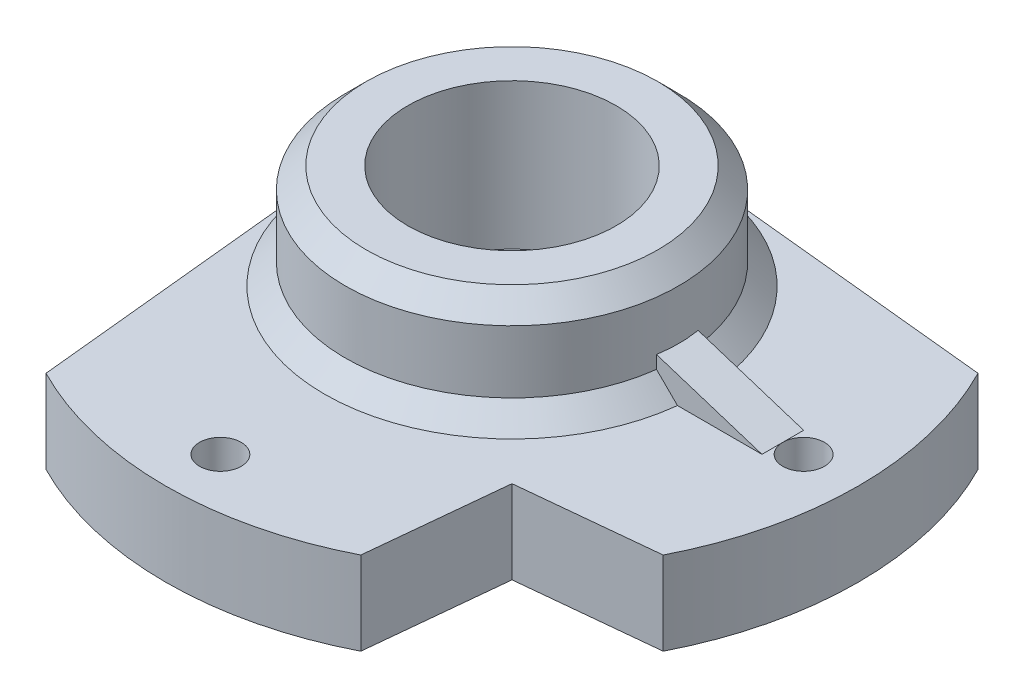
ISO-10303-21;
HEADER;
FILE_DESCRIPTION(('STEP AP214'),'2;1');
FILE_NAME('part.step','',(''),(''),'','','');
FILE_SCHEMA(('AUTOMOTIVE_DESIGN { 1 0 10303 214 1 1 1 1 }'));
ENDSEC;
DATA;
#1=APPLICATION_CONTEXT('core data for automotive mechanical design processes');
#2=APPLICATION_PROTOCOL_DEFINITION('international standard','automotive_design',2000,#1);
#3=PRODUCT_CONTEXT('',#1,'mechanical');
#4=PRODUCT('Part','Part','',(#3));
#5=PRODUCT_RELATED_PRODUCT_CATEGORY('part','',(#4));
#6=PRODUCT_DEFINITION_FORMATION('','',#4);
#7=PRODUCT_DEFINITION_CONTEXT('part definition',#1,'design');
#8=PRODUCT_DEFINITION('design','',#6,#7);
#9=PRODUCT_DEFINITION_SHAPE('','',#8);
#10=(LENGTH_UNIT() NAMED_UNIT(*) SI_UNIT(.MILLI.,.METRE.));
#11=(NAMED_UNIT(*) PLANE_ANGLE_UNIT() SI_UNIT($,.RADIAN.));
#12=(NAMED_UNIT(*) SI_UNIT($,.STERADIAN.) SOLID_ANGLE_UNIT());
#13=UNCERTAINTY_MEASURE_WITH_UNIT(LENGTH_MEASURE(1.E-05),#10,'distance_accuracy_value','');
#14=(GEOMETRIC_REPRESENTATION_CONTEXT(3) GLOBAL_UNCERTAINTY_ASSIGNED_CONTEXT((#13)) GLOBAL_UNIT_ASSIGNED_CONTEXT((#10,
#11,#12)) REPRESENTATION_CONTEXT('',''));
#15=CARTESIAN_POINT('',(0.,0.,0.));
#16=DIRECTION('',(0.,0.,1.));
#17=DIRECTION('',(1.,0.,0.));
#18=AXIS2_PLACEMENT_3D('',#15,#16,#17);
#19=CARTESIAN_POINT('',(0.,0.,0.));
#20=DIRECTION('',(0.,1.,0.));
#21=DIRECTION('',(0.,0.,1.));
#22=AXIS2_PLACEMENT_3D('',#19,#20,#21);
#23=PLANE('',#22);
#24=CARTESIAN_POINT('',(0.,0.,0.));
#25=DIRECTION('',(0.,1.,0.));
#26=DIRECTION('',(0.,0.,1.));
#27=AXIS2_PLACEMENT_3D('',#24,#25,#26);
#28=CIRCLE('',#27,3.5);
#29=CARTESIAN_POINT('',(0.,0.,3.5));
#30=VERTEX_POINT('',#29);
#31=EDGE_CURVE('E249',#30,#30,#28,.F.);
#32=ORIENTED_EDGE('',*,*,#31,.F.);
#33=EDGE_LOOP('',(#32));
#34=FACE_BOUND('',#33,.T.);
#35=CARTESIAN_POINT('',(7.00000000000001,0.,0.));
#36=DIRECTION('',(0.,1.,0.));
#37=DIRECTION('',(0.,0.,1.));
#38=AXIS2_PLACEMENT_3D('',#35,#36,#37);
#39=CIRCLE('',#38,0.499999999999999);
#40=CARTESIAN_POINT('',(7.00000000000001,0.,0.499999999999999));
#41=VERTEX_POINT('',#40);
#42=EDGE_CURVE('E243',#41,#41,#39,.F.);
#43=ORIENTED_EDGE('',*,*,#42,.F.);
#44=EDGE_LOOP('',(#43));
#45=FACE_BOUND('',#44,.T.);
#46=CARTESIAN_POINT('',(0.,0.,7.00000000000001));
#47=DIRECTION('',(0.,-1.,0.));
#48=DIRECTION('',(0.,0.,-1.));
#49=AXIS2_PLACEMENT_3D('',#46,#47,#48);
#50=CIRCLE('',#49,0.499999999999999);
#51=CARTESIAN_POINT('',(0.,0.,6.50000000000001));
#52=VERTEX_POINT('',#51);
#53=EDGE_CURVE('E142',#52,#52,#50,.T.);
#54=ORIENTED_EDGE('',*,*,#53,.F.);
#55=EDGE_LOOP('',(#54));
#56=FACE_BOUND('',#55,.T.);
#57=CARTESIAN_POINT('',(0.,0.,0.));
#58=DIRECTION('',(0.,1.,0.));
#59=DIRECTION('',(0.,0.,1.));
#60=AXIS2_PLACEMENT_3D('',#57,#58,#59);
#61=CIRCLE('',#60,8.31530299029882);
#62=CARTESIAN_POINT('',(7.40739327494629,0.,3.77819913328467));
#63=VERTEX_POINT('',#62);
#64=CARTESIAN_POINT('',(7.40739327494629,0.,-3.77819913328468));
#65=VERTEX_POINT('',#64);
#66=EDGE_CURVE('E48',#63,#65,#61,.T.);
#67=ORIENTED_EDGE('',*,*,#66,.F.);
#68=DIRECTION('',(0.99498743710662,0.,-0.1));
#69=VECTOR('',#68,1.);
#70=CARTESIAN_POINT('',(0.45,0.,4.47744346697979));
#71=LINE('',#70,#69);
#72=CARTESIAN_POINT('',(4.10963619079574,0.,4.1096361907957));
#73=VERTEX_POINT('',#72);
#74=EDGE_CURVE('E484',#73,#63,#71,.T.);
#75=ORIENTED_EDGE('',*,*,#74,.F.);
#76=DIRECTION('',(-0.0999999999999894,0.,0.994987437106621));
#77=VECTOR('',#76,1.);
#78=CARTESIAN_POINT('',(4.10963619079574,0.,4.1096361907957));
#79=LINE('',#78,#77);
#80=CARTESIAN_POINT('',(3.77819913328475,0.,7.40739327494625));
#81=VERTEX_POINT('',#80);
#82=EDGE_CURVE('E139',#73,#81,#79,.T.);
#83=ORIENTED_EDGE('',*,*,#82,.T.);
#84=CARTESIAN_POINT('',(-3.7781991332846,0.,7.40739327494633));
#85=VERTEX_POINT('',#84);
#86=EDGE_CURVE('E56',#85,#81,#61,.T.);
#87=ORIENTED_EDGE('',*,*,#86,.F.);
#88=DIRECTION('',(-0.10000000000001,0.,-0.994987437106619));
#89=VECTOR('',#88,1.);
#90=CARTESIAN_POINT('',(-4.10963619079566,0.,4.10963619079573));
#91=LINE('',#90,#89);
#92=CARTESIAN_POINT('',(-4.47744346697978,0.,0.450000000000046));
#93=VERTEX_POINT('',#92);
#94=EDGE_CURVE('E136',#85,#93,#91,.T.);
#95=ORIENTED_EDGE('',*,*,#94,.T.);
#96=CARTESIAN_POINT('',(0.,0.,0.));
#97=DIRECTION('',(0.,1.,0.));
#98=DIRECTION('',(0.,0.,-1.));
#99=AXIS2_PLACEMENT_3D('',#96,#97,#98);
#100=CIRCLE('',#99,4.5);
#101=CARTESIAN_POINT('',(0.449999999999999,0.,-4.47744346697979));
#102=VERTEX_POINT('',#101);
#103=EDGE_CURVE('E446',#102,#93,#100,.T.);
#104=ORIENTED_EDGE('',*,*,#103,.F.);
#105=DIRECTION('',(0.99498743710662,0.,0.0999999999999998));
#106=VECTOR('',#105,1.);
#107=CARTESIAN_POINT('',(0.449999999999999,0.,-4.47744346697979));
#108=LINE('',#107,#106);
#109=EDGE_CURVE('E473',#102,#65,#108,.T.);
#110=ORIENTED_EDGE('',*,*,#109,.T.);
#111=EDGE_LOOP('',(#67,#75,#83,#87,#95,#104,#110));
#112=FACE_BOUND('',#111,.T.);
#113=ADVANCED_FACE('F33',(#34,#45,#56,#112),#23,.F.);
#114=CARTESIAN_POINT('',(0.,2.,0.));
#115=DIRECTION('',(0.,1.,0.));
#116=DIRECTION('',(0.,0.,1.));
#117=AXIS2_PLACEMENT_3D('',#114,#115,#116);
#118=PLANE('',#117);
#119=CARTESIAN_POINT('',(0.,2.,7.00000000000001));
#120=DIRECTION('',(0.,-1.,0.));
#121=DIRECTION('',(0.,0.,-1.));
#122=AXIS2_PLACEMENT_3D('',#119,#120,#121);
#123=CIRCLE('',#122,0.499999999999999);
#124=CARTESIAN_POINT('',(0.,2.,6.50000000000001));
#125=VERTEX_POINT('',#124);
#126=EDGE_CURVE('E145',#125,#125,#123,.T.);
#127=ORIENTED_EDGE('',*,*,#126,.T.);
#128=EDGE_LOOP('',(#127));
#129=FACE_BOUND('',#128,.T.);
#130=DIRECTION('',(0.99498743710662,0.,-0.1));
#131=VECTOR('',#130,1.);
#132=CARTESIAN_POINT('',(0.45,2.,4.47744346697979));
#133=LINE('',#132,#131);
#134=CARTESIAN_POINT('',(4.10963619079574,2.,4.1096361907957));
#135=VERTEX_POINT('',#134);
#136=CARTESIAN_POINT('',(7.40739327494629,2.,3.77819913328467));
#137=VERTEX_POINT('',#136);
#138=EDGE_CURVE('E477',#135,#137,#133,.T.);
#139=ORIENTED_EDGE('',*,*,#138,.T.);
#140=CARTESIAN_POINT('',(0.,2.,0.));
#141=DIRECTION('',(0.,1.,0.));
#142=DIRECTION('',(0.,0.,1.));
#143=AXIS2_PLACEMENT_3D('',#140,#141,#142);
#144=CIRCLE('',#143,8.31530299029882);
#145=CARTESIAN_POINT('',(7.40739327494629,2.,-3.77819913328468));
#146=VERTEX_POINT('',#145);
#147=EDGE_CURVE('E132',#137,#146,#144,.T.);
#148=ORIENTED_EDGE('',*,*,#147,.T.);
#149=DIRECTION('',(0.99498743710662,0.,0.0999999999999998));
#150=VECTOR('',#149,1.);
#151=CARTESIAN_POINT('',(0.449999999999999,2.,-4.47744346697979));
#152=LINE('',#151,#150);
#153=CARTESIAN_POINT('',(0.449999999999999,2.,-4.47744346697979));
#154=VERTEX_POINT('',#153);
#155=EDGE_CURVE('E472',#154,#146,#152,.T.);
#156=ORIENTED_EDGE('',*,*,#155,.F.);
#157=CARTESIAN_POINT('',(0.,2.,0.));
#158=DIRECTION('',(0.,1.,0.));
#159=DIRECTION('',(0.,0.,1.));
#160=AXIS2_PLACEMENT_3D('',#157,#158,#159);
#161=CIRCLE('',#160,4.5);
#162=CARTESIAN_POINT('',(4.47213595499958,2.,-0.5));
#163=VERTEX_POINT('',#162);
#164=EDGE_CURVE('E475',#163,#154,#161,.T.);
#165=ORIENTED_EDGE('',*,*,#164,.F.);
#166=DIRECTION('',(1.,0.,0.));
#167=VECTOR('',#166,1.);
#168=CARTESIAN_POINT('',(0.,2.,-0.5));
#169=LINE('',#168,#167);
#170=CARTESIAN_POINT('',(6.50000000000001,2.,-0.5));
#171=VERTEX_POINT('',#170);
#172=EDGE_CURVE('E530',#163,#171,#169,.T.);
#173=ORIENTED_EDGE('',*,*,#172,.T.);
#174=DIRECTION('',(0.,0.,1.));
#175=VECTOR('',#174,1.);
#176=CARTESIAN_POINT('',(6.50000000000001,2.,0.));
#177=LINE('',#176,#175);
#178=CARTESIAN_POINT('',(6.50000000000001,2.,0.));
#179=VERTEX_POINT('',#178);
#180=EDGE_CURVE('E516',#179,#171,#177,.F.);
#181=ORIENTED_EDGE('',*,*,#180,.F.);
#182=CARTESIAN_POINT('',(7.00000000000001,2.,0.));
#183=DIRECTION('',(0.,1.,0.));
#184=DIRECTION('',(0.,0.,1.));
#185=AXIS2_PLACEMENT_3D('',#182,#183,#184);
#186=CIRCLE('',#185,0.499999999999999);
#187=EDGE_CURVE('E240',#179,#179,#186,.T.);
#188=ORIENTED_EDGE('',*,*,#187,.F.);
#189=CARTESIAN_POINT('',(6.50000000000001,2.,0.5));
#190=VERTEX_POINT('',#189);
#191=EDGE_CURVE('E515',#190,#179,#177,.F.);
#192=ORIENTED_EDGE('',*,*,#191,.F.);
#193=DIRECTION('',(1.,0.,0.));
#194=VECTOR('',#193,1.);
#195=CARTESIAN_POINT('',(0.,2.,0.5));
#196=LINE('',#195,#194);
#197=CARTESIAN_POINT('',(4.47213595499958,2.,0.5));
#198=VERTEX_POINT('',#197);
#199=EDGE_CURVE('E521',#198,#190,#196,.T.);
#200=ORIENTED_EDGE('',*,*,#199,.F.);
#201=CARTESIAN_POINT('',(-4.47744346697978,2.,0.450000000000046));
#202=VERTEX_POINT('',#201);
#203=EDGE_CURVE('E479',#202,#198,#161,.T.);
#204=ORIENTED_EDGE('',*,*,#203,.F.);
#205=DIRECTION('',(-0.10000000000001,0.,-0.994987437106619));
#206=VECTOR('',#205,1.);
#207=CARTESIAN_POINT('',(-4.10963619079566,2.,4.10963619079573));
#208=LINE('',#207,#206);
#209=CARTESIAN_POINT('',(-3.7781991332846,2.,7.40739327494633));
#210=VERTEX_POINT('',#209);
#211=EDGE_CURVE('E130',#210,#202,#208,.T.);
#212=ORIENTED_EDGE('',*,*,#211,.F.);
#213=CARTESIAN_POINT('',(3.77819913328475,2.,7.40739327494625));
#214=VERTEX_POINT('',#213);
#215=EDGE_CURVE('E117',#210,#214,#144,.T.);
#216=ORIENTED_EDGE('',*,*,#215,.T.);
#217=DIRECTION('',(-0.0999999999999894,0.,0.994987437106621));
#218=VECTOR('',#217,1.);
#219=CARTESIAN_POINT('',(4.10963619079574,2.,4.1096361907957));
#220=LINE('',#219,#218);
#221=EDGE_CURVE('E127',#135,#214,#220,.T.);
#222=ORIENTED_EDGE('',*,*,#221,.F.);
#223=EDGE_LOOP('',(#139,#148,#156,#165,#173,#181,#188,#192,#200,#204,#212,#216,#222));
#224=FACE_BOUND('',#223,.T.);
#225=ADVANCED_FACE('F126',(#129,#224),#118,.T.);
#226=CARTESIAN_POINT('',(0.45,2.,4.47744346697979));
#227=DIRECTION('',(-0.1,0.,-0.99498743710662));
#228=DIRECTION('',(-0.99498743710662,0.,0.1));
#229=AXIS2_PLACEMENT_3D('',#226,#227,#228);
#230=PLANE('',#229);
#231=DIRECTION('',(0.,-1.,0.));
#232=VECTOR('',#231,1.);
#233=CARTESIAN_POINT('',(7.40739327494629,4.5,3.77819913328468));
#234=LINE('',#233,#232);
#235=EDGE_CURVE('E451',#137,#63,#234,.T.);
#236=ORIENTED_EDGE('',*,*,#235,.F.);
#237=ORIENTED_EDGE('',*,*,#138,.F.);
#238=DIRECTION('',(0.,-1.,0.));
#239=VECTOR('',#238,1.);
#240=CARTESIAN_POINT('',(4.10963619079574,2.,4.1096361907957));
#241=LINE('',#240,#239);
#242=EDGE_CURVE('E135',#135,#73,#241,.T.);
#243=ORIENTED_EDGE('',*,*,#242,.T.);
#244=ORIENTED_EDGE('',*,*,#74,.T.);
#245=EDGE_LOOP('',(#236,#237,#243,#244));
#246=FACE_BOUND('',#245,.T.);
#247=ADVANCED_FACE('F219',(#246),#230,.F.);
#248=CARTESIAN_POINT('',(0.449999999999999,2.,-4.47744346697979));
#249=DIRECTION('',(0.0999999999999999,0.,-0.99498743710662));
#250=DIRECTION('',(-0.99498743710662,0.,-0.0999999999999998));
#251=AXIS2_PLACEMENT_3D('',#248,#249,#250);
#252=PLANE('',#251);
#253=ORIENTED_EDGE('',*,*,#155,.T.);
#254=DIRECTION('',(0.,-1.,0.));
#255=VECTOR('',#254,1.);
#256=CARTESIAN_POINT('',(7.40739327494629,4.5,-3.77819913328468));
#257=LINE('',#256,#255);
#258=EDGE_CURVE('E449',#146,#65,#257,.T.);
#259=ORIENTED_EDGE('',*,*,#258,.T.);
#260=ORIENTED_EDGE('',*,*,#109,.F.);
#261=DIRECTION('',(0.,-1.,0.));
#262=VECTOR('',#261,1.);
#263=CARTESIAN_POINT('',(0.449999999999999,10.,-4.47744346697979));
#264=LINE('',#263,#262);
#265=EDGE_CURVE('E458',#154,#102,#264,.T.);
#266=ORIENTED_EDGE('',*,*,#265,.F.);
#267=EDGE_LOOP('',(#253,#259,#260,#266));
#268=FACE_BOUND('',#267,.T.);
#269=ADVANCED_FACE('F224',(#268),#252,.T.);
#270=CARTESIAN_POINT('',(-4.10963619079566,2.,4.10963619079573));
#271=DIRECTION('',(-0.994987437106619,0.,0.10000000000001));
#272=DIRECTION('',(0.10000000000001,0.,0.994987437106619));
#273=AXIS2_PLACEMENT_3D('',#270,#271,#272);
#274=PLANE('',#273);
#275=ORIENTED_EDGE('',*,*,#94,.F.);
#276=DIRECTION('',(0.,-1.,0.));
#277=VECTOR('',#276,1.);
#278=CARTESIAN_POINT('',(-3.7781991332846,4.5,7.40739327494633));
#279=LINE('',#278,#277);
#280=EDGE_CURVE('E439',#85,#210,#279,.F.);
#281=ORIENTED_EDGE('',*,*,#280,.T.);
#282=ORIENTED_EDGE('',*,*,#211,.T.);
#283=DIRECTION('',(0.,-1.,0.));
#284=VECTOR('',#283,1.);
#285=CARTESIAN_POINT('',(-4.47744346697978,10.,0.450000000000046));
#286=LINE('',#285,#284);
#287=EDGE_CURVE('E441',#202,#93,#286,.T.);
#288=ORIENTED_EDGE('',*,*,#287,.T.);
#289=EDGE_LOOP('',(#275,#281,#282,#288));
#290=FACE_BOUND('',#289,.T.);
#291=ADVANCED_FACE('F227',(#290),#274,.T.);
#292=CARTESIAN_POINT('',(4.10963619079574,2.,4.1096361907957));
#293=DIRECTION('',(0.994987437106621,0.,0.0999999999999894));
#294=DIRECTION('',(0.0999999999999894,0.,-0.994987437106621));
#295=AXIS2_PLACEMENT_3D('',#292,#293,#294);
#296=PLANE('',#295);
#297=ORIENTED_EDGE('',*,*,#221,.T.);
#298=DIRECTION('',(0.,-1.,0.));
#299=VECTOR('',#298,1.);
#300=CARTESIAN_POINT('',(3.77819913328475,4.5,7.40739327494625));
#301=LINE('',#300,#299);
#302=EDGE_CURVE('E12',#214,#81,#301,.T.);
#303=ORIENTED_EDGE('',*,*,#302,.T.);
#304=ORIENTED_EDGE('',*,*,#82,.F.);
#305=ORIENTED_EDGE('',*,*,#242,.F.);
#306=EDGE_LOOP('',(#297,#303,#304,#305));
#307=FACE_BOUND('',#306,.T.);
#308=ADVANCED_FACE('F133',(#307),#296,.T.);
#309=CARTESIAN_POINT('',(0.,-0.301,0.));
#310=DIRECTION('',(0.,1.,0.));
#311=DIRECTION('',(0.,0.,1.));
#312=AXIS2_PLACEMENT_3D('',#309,#310,#311);
#313=CYLINDRICAL_SURFACE('',#312,1.35);
#314=CARTESIAN_POINT('',(0.,0.3,0.));
#315=DIRECTION('',(0.,-1.,0.));
#316=DIRECTION('',(0.,0.,-1.));
#317=AXIS2_PLACEMENT_3D('',#314,#315,#316);
#318=CIRCLE('',#317,1.35);
#319=CARTESIAN_POINT('',(0.,0.3,-1.35));
#320=VERTEX_POINT('',#319);
#321=EDGE_CURVE('E512',#320,#320,#318,.T.);
#322=ORIENTED_EDGE('',*,*,#321,.T.);
#323=EDGE_LOOP('',(#322));
#324=FACE_BOUND('',#323,.T.);
#325=CARTESIAN_POINT('',(0.,1.,0.));
#326=DIRECTION('',(0.,1.,0.));
#327=DIRECTION('',(0.,0.,1.));
#328=AXIS2_PLACEMENT_3D('',#325,#326,#327);
#329=CIRCLE('',#328,1.35);
#330=CARTESIAN_POINT('',(0.,1.,1.35));
#331=VERTEX_POINT('',#330);
#332=EDGE_CURVE('E504',#331,#331,#329,.T.);
#333=ORIENTED_EDGE('',*,*,#332,.T.);
#334=EDGE_LOOP('',(#333));
#335=FACE_BOUND('',#334,.T.);
#336=ADVANCED_FACE('F186',(#324,#335),#313,.F.);
#337=CARTESIAN_POINT('',(0.,4.5,0.));
#338=DIRECTION('',(0.,-1.,0.));
#339=DIRECTION('',(0.,0.,-1.));
#340=AXIS2_PLACEMENT_3D('',#337,#338,#339);
#341=CYLINDRICAL_SURFACE('',#340,4.);
#342=CARTESIAN_POINT('',(0.,2.50000000000001,0.));
#343=DIRECTION('',(0.,1.,0.));
#344=DIRECTION('',(0.,0.,1.));
#345=AXIS2_PLACEMENT_3D('',#342,#343,#344);
#346=CIRCLE('',#345,4.);
#347=CARTESIAN_POINT('',(3.96862696659689,2.50000000000001,-0.5));
#348=VERTEX_POINT('',#347);
#349=CARTESIAN_POINT('',(3.96862696659689,2.50000000000001,0.5));
#350=VERTEX_POINT('',#349);
#351=EDGE_CURVE('E245',#348,#350,#346,.T.);
#352=ORIENTED_EDGE('',*,*,#351,.T.);
#353=DIRECTION('',(0.,-1.,0.));
#354=VECTOR('',#353,1.);
#355=CARTESIAN_POINT('',(3.96862696659689,4.5,0.5));
#356=LINE('',#355,#354);
#357=CARTESIAN_POINT('',(3.96862696659689,2.810039370689,0.5));
#358=VERTEX_POINT('',#357);
#359=EDGE_CURVE('E524',#350,#358,#356,.F.);
#360=ORIENTED_EDGE('',*,*,#359,.T.);
#361=CARTESIAN_POINT('',(0.,4.07999999999999,0.));
#362=DIRECTION('',(-0.304775727103783,-0.952424147199324,0.));
#363=DIRECTION('',(0.952424147199325,-0.304775727103783,0.));
#364=AXIS2_PLACEMENT_3D('',#361,#362,#363);
#365=ELLIPSE('',#364,4.19980951949014,4.);
#366=CARTESIAN_POINT('',(3.96862696659689,2.810039370689,-0.5));
#367=VERTEX_POINT('',#366);
#368=EDGE_CURVE('E519',#358,#367,#365,.F.);
#369=ORIENTED_EDGE('',*,*,#368,.T.);
#370=DIRECTION('',(0.,-1.,0.));
#371=VECTOR('',#370,1.);
#372=CARTESIAN_POINT('',(3.96862696659689,4.5,-0.5));
#373=LINE('',#372,#371);
#374=EDGE_CURVE('E161',#348,#367,#373,.F.);
#375=ORIENTED_EDGE('',*,*,#374,.F.);
#376=EDGE_LOOP('',(#352,#360,#369,#375));
#377=FACE_BOUND('',#376,.T.);
#378=CARTESIAN_POINT('',(0.,3.99999999999999,0.));
#379=DIRECTION('',(0.,1.,0.));
#380=DIRECTION('',(0.,0.,1.));
#381=AXIS2_PLACEMENT_3D('',#378,#379,#380);
#382=CIRCLE('',#381,4.);
#383=CARTESIAN_POINT('',(0.,3.99999999999999,4.));
#384=VERTEX_POINT('',#383);
#385=EDGE_CURVE('E41',#384,#384,#382,.F.);
#386=ORIENTED_EDGE('',*,*,#385,.T.);
#387=EDGE_LOOP('',(#386));
#388=FACE_BOUND('',#387,.T.);
#389=ADVANCED_FACE('F189',(#377,#388),#341,.T.);
#390=CARTESIAN_POINT('',(0.,4.5,0.));
#391=DIRECTION('',(0.,1.,0.));
#392=DIRECTION('',(0.,0.,1.));
#393=AXIS2_PLACEMENT_3D('',#390,#391,#392);
#394=PLANE('',#393);
#395=CARTESIAN_POINT('',(0.,4.5,0.));
#396=DIRECTION('',(0.,1.,0.));
#397=DIRECTION('',(0.,0.,1.));
#398=AXIS2_PLACEMENT_3D('',#395,#396,#397);
#399=CIRCLE('',#398,2.5);
#400=CARTESIAN_POINT('',(0.,4.5,2.5));
#401=VERTEX_POINT('',#400);
#402=EDGE_CURVE('E501',#401,#401,#399,.T.);
#403=ORIENTED_EDGE('',*,*,#402,.F.);
#404=EDGE_LOOP('',(#403));
#405=FACE_BOUND('',#404,.T.);
#406=CARTESIAN_POINT('',(0.,4.5,0.));
#407=DIRECTION('',(0.,1.,0.));
#408=DIRECTION('',(0.,0.,1.));
#409=AXIS2_PLACEMENT_3D('',#406,#407,#408);
#410=CIRCLE('',#409,3.5);
#411=CARTESIAN_POINT('',(0.,4.5,3.5));
#412=VERTEX_POINT('',#411);
#413=EDGE_CURVE('E247',#412,#412,#410,.T.);
#414=ORIENTED_EDGE('',*,*,#413,.T.);
#415=EDGE_LOOP('',(#414));
#416=FACE_BOUND('',#415,.T.);
#417=ADVANCED_FACE('F206',(#405,#416),#394,.T.);
#418=CARTESIAN_POINT('',(0.,-0.3,0.));
#419=DIRECTION('',(0.,-1.,0.));
#420=DIRECTION('',(0.,0.,-1.));
#421=AXIS2_PLACEMENT_3D('',#418,#419,#420);
#422=PLANE('',#421);
#423=CARTESIAN_POINT('',(0.,-0.3,0.));
#424=DIRECTION('',(0.,-1.,0.));
#425=DIRECTION('',(0.,0.,-1.));
#426=AXIS2_PLACEMENT_3D('',#423,#424,#425);
#427=CIRCLE('',#426,2.5);
#428=CARTESIAN_POINT('',(0.,-0.3,-2.5));
#429=VERTEX_POINT('',#428);
#430=EDGE_CURVE('E496',#429,#429,#427,.T.);
#431=ORIENTED_EDGE('',*,*,#430,.F.);
#432=EDGE_LOOP('',(#431));
#433=FACE_BOUND('',#432,.T.);
#434=CARTESIAN_POINT('',(0.,-0.3,0.));
#435=DIRECTION('',(0.,-1.,0.));
#436=DIRECTION('',(0.,0.,-1.));
#437=AXIS2_PLACEMENT_3D('',#434,#435,#436);
#438=CIRCLE('',#437,3.5);
#439=CARTESIAN_POINT('',(0.,-0.3,-3.5));
#440=VERTEX_POINT('',#439);
#441=EDGE_CURVE('E487',#440,#440,#438,.T.);
#442=ORIENTED_EDGE('',*,*,#441,.T.);
#443=EDGE_LOOP('',(#442));
#444=FACE_BOUND('',#443,.T.);
#445=ADVANCED_FACE('F203',(#433,#444),#422,.T.);
#446=CARTESIAN_POINT('',(0.,-0.3,0.));
#447=DIRECTION('',(0.,1.,0.));
#448=DIRECTION('',(0.,0.,1.));
#449=AXIS2_PLACEMENT_3D('',#446,#447,#448);
#450=CYLINDRICAL_SURFACE('',#449,3.5);
#451=ORIENTED_EDGE('',*,*,#31,.T.);
#452=EDGE_LOOP('',(#451));
#453=FACE_BOUND('',#452,.T.);
#454=ORIENTED_EDGE('',*,*,#441,.F.);
#455=EDGE_LOOP('',(#454));
#456=FACE_BOUND('',#455,.T.);
#457=ADVANCED_FACE('F201',(#453,#456),#450,.T.);
#458=CARTESIAN_POINT('',(0.,-0.3,0.));
#459=DIRECTION('',(0.,1.,0.));
#460=DIRECTION('',(0.,0.,1.));
#461=AXIS2_PLACEMENT_3D('',#458,#459,#460);
#462=CYLINDRICAL_SURFACE('',#461,2.5);
#463=ORIENTED_EDGE('',*,*,#430,.T.);
#464=EDGE_LOOP('',(#463));
#465=FACE_BOUND('',#464,.T.);
#466=CARTESIAN_POINT('',(0.,0.3,0.));
#467=DIRECTION('',(0.,-1.,0.));
#468=DIRECTION('',(0.,0.,-1.));
#469=AXIS2_PLACEMENT_3D('',#466,#467,#468);
#470=CIRCLE('',#469,2.5);
#471=CARTESIAN_POINT('',(0.,0.3,-2.5));
#472=VERTEX_POINT('',#471);
#473=EDGE_CURVE('E509',#472,#472,#470,.T.);
#474=ORIENTED_EDGE('',*,*,#473,.F.);
#475=EDGE_LOOP('',(#474));
#476=FACE_BOUND('',#475,.T.);
#477=ADVANCED_FACE('F197',(#465,#476),#462,.F.);
#478=CARTESIAN_POINT('',(0.,1.,0.));
#479=DIRECTION('',(0.,1.,0.));
#480=DIRECTION('',(0.,0.,1.));
#481=AXIS2_PLACEMENT_3D('',#478,#479,#480);
#482=CYLINDRICAL_SURFACE('',#481,2.5);
#483=CARTESIAN_POINT('',(0.,1.,0.));
#484=DIRECTION('',(0.,1.,0.));
#485=DIRECTION('',(0.,0.,1.));
#486=AXIS2_PLACEMENT_3D('',#483,#484,#485);
#487=CIRCLE('',#486,2.5);
#488=CARTESIAN_POINT('',(0.,1.,2.5));
#489=VERTEX_POINT('',#488);
#490=EDGE_CURVE('E498',#489,#489,#487,.T.);
#491=ORIENTED_EDGE('',*,*,#490,.F.);
#492=EDGE_LOOP('',(#491));
#493=FACE_BOUND('',#492,.T.);
#494=ORIENTED_EDGE('',*,*,#402,.T.);
#495=EDGE_LOOP('',(#494));
#496=FACE_BOUND('',#495,.T.);
#497=ADVANCED_FACE('F193',(#493,#496),#482,.F.);
#498=CARTESIAN_POINT('',(0.,1.,0.));
#499=DIRECTION('',(0.,1.,0.));
#500=DIRECTION('',(0.,0.,1.));
#501=AXIS2_PLACEMENT_3D('',#498,#499,#500);
#502=PLANE('',#501);
#503=ORIENTED_EDGE('',*,*,#332,.F.);
#504=EDGE_LOOP('',(#503));
#505=FACE_BOUND('',#504,.T.);
#506=ORIENTED_EDGE('',*,*,#490,.T.);
#507=EDGE_LOOP('',(#506));
#508=FACE_BOUND('',#507,.T.);
#509=ADVANCED_FACE('F184',(#505,#508),#502,.T.);
#510=CARTESIAN_POINT('',(0.,0.3,0.));
#511=DIRECTION('',(0.,-1.,0.));
#512=DIRECTION('',(0.,0.,-1.));
#513=AXIS2_PLACEMENT_3D('',#510,#511,#512);
#514=PLANE('',#513);
#515=ORIENTED_EDGE('',*,*,#321,.F.);
#516=EDGE_LOOP('',(#515));
#517=FACE_BOUND('',#516,.T.);
#518=ORIENTED_EDGE('',*,*,#473,.T.);
#519=EDGE_LOOP('',(#518));
#520=FACE_BOUND('',#519,.T.);
#521=ADVANCED_FACE('F180',(#517,#520),#514,.T.);
#522=CARTESIAN_POINT('',(7.00000000000001,-0.301,0.));
#523=DIRECTION('',(0.,1.,0.));
#524=DIRECTION('',(0.,0.,1.));
#525=AXIS2_PLACEMENT_3D('',#522,#523,#524);
#526=CYLINDRICAL_SURFACE('',#525,0.499999999999999);
#527=ORIENTED_EDGE('',*,*,#187,.T.);
#528=EDGE_LOOP('',(#527));
#529=FACE_BOUND('',#528,.T.);
#530=ORIENTED_EDGE('',*,*,#42,.T.);
#531=EDGE_LOOP('',(#530));
#532=FACE_BOUND('',#531,.T.);
#533=ADVANCED_FACE('F183',(#529,#532),#526,.F.);
#534=CARTESIAN_POINT('',(0.,2.50000000000001,0.));
#535=DIRECTION('',(0.,-1.,0.));
#536=DIRECTION('',(0.,0.,-1.));
#537=AXIS2_PLACEMENT_3D('',#534,#535,#536);
#538=CONICAL_SURFACE('',#537,4.,0.785398163397441);
#539=ORIENTED_EDGE('',*,*,#164,.T.);
#540=EDGE_CURVE('E470',#154,#202,#161,.T.);
#541=ORIENTED_EDGE('',*,*,#540,.T.);
#542=ORIENTED_EDGE('',*,*,#203,.T.);
#543=CARTESIAN_POINT('',(9.89590347515211,-3.40852691319598,0.5));
#544=CARTESIAN_POINT('',(9.55754945793178,-3.07060741252557,0.5));
#545=CARTESIAN_POINT('',(9.21917661015534,-2.73270675664088,0.5));
#546=CARTESIAN_POINT('',(8.54236671432963,-2.05696500163337,0.5));
#547=CARTESIAN_POINT('',(8.20392966584675,-1.71912390294484,0.5));
#548=CARTESIAN_POINT('',(7.52691541260064,-1.04347381707137,0.5));
#549=CARTESIAN_POINT('',(7.18833819407591,-0.705664843675145,0.5));
#550=CARTESIAN_POINT('',(6.51105638737073,-0.0301792111346193,0.5));
#551=CARTESIAN_POINT('',(6.17235180007695,0.307497448898522,0.5));
#552=CARTESIAN_POINT('',(5.48700914449833,0.990336201412619,0.5));
#553=CARTESIAN_POINT('',(5.14036624498886,1.33549344504014,0.5));
#554=CARTESIAN_POINT('',(4.44669403602822,2.02543373511544,0.5));
#555=CARTESIAN_POINT('',(4.09966471892604,2.37021677387716,0.5));
#556=CARTESIAN_POINT('',(3.57853950614138,2.88676957712157,0.5));
#557=CARTESIAN_POINT('',(3.4047431652943,3.05884140217669,0.5));
#558=CARTESIAN_POINT('',(3.05682956444365,3.40266319432691,0.5));
#559=CARTESIAN_POINT('',(2.88271230182098,3.57441315877197,0.5));
#560=CARTESIAN_POINT('',(2.53396283642773,3.91737755367745,0.5));
#561=CARTESIAN_POINT('',(2.35933065316033,4.08859200392748,0.5));
#562=CARTESIAN_POINT('',(2.09664048952969,4.34465062179337,0.5));
#563=CARTESIAN_POINT('',(2.00895404094525,4.42987575218824,0.5));
#564=CARTESIAN_POINT('',(1.83321755870129,4.59995012050514,0.5));
#565=CARTESIAN_POINT('',(1.74516752680797,4.684799360249,0.5));
#566=CARTESIAN_POINT('',(1.60904335539765,4.8151164999807,0.5));
#567=CARTESIAN_POINT('',(1.56116546264021,4.86078929628022,0.5));
#568=CARTESIAN_POINT('',(1.4651971444848,4.9519123761549,0.5));
#569=CARTESIAN_POINT('',(1.4171067164316,4.99736265693508,0.5));
#570=CARTESIAN_POINT('',(1.32075784385142,5.08786422067677,0.5));
#571=CARTESIAN_POINT('',(1.27250003407477,5.13291617791471,0.5));
#572=CARTESIAN_POINT('',(1.17560877506877,5.22261095571533,0.5));
#573=CARTESIAN_POINT('',(1.12697533745554,5.26725378883737,0.5));
#574=CARTESIAN_POINT('',(1.01263433128632,5.37099419281247,0.5));
#575=CARTESIAN_POINT('',(0.946721447129669,5.42986767622625,0.5));
#576=CARTESIAN_POINT('',(0.846543842359696,5.51695941434939,0.5));
#577=CARTESIAN_POINT('',(0.812861376610706,5.54584609162679,0.5));
#578=CARTESIAN_POINT('',(0.744964714885904,5.60298613332747,0.5));
#579=CARTESIAN_POINT('',(0.71075055219924,5.63123953713117,0.5));
#580=CARTESIAN_POINT('',(0.641292410469585,5.6870886391154,0.5));
#581=CARTESIAN_POINT('',(0.606042049430044,5.71467644422043,0.5));
#582=CARTESIAN_POINT('',(0.534506835901469,5.76846767679602,0.5));
#583=CARTESIAN_POINT('',(0.498222350792911,5.79467158669548,0.5));
#584=CARTESIAN_POINT('',(0.424325281703803,5.84477920370247,0.5));
#585=CARTESIAN_POINT('',(0.386719668616044,5.8686930533328,0.5));
#586=CARTESIAN_POINT('',(0.309446037539682,5.91284615240152,0.5));
#587=CARTESIAN_POINT('',(0.269783796494129,5.93309504604604,0.5));
#588=CARTESIAN_POINT('',(0.198015133198507,5.96293784682987,0.5));
#589=CARTESIAN_POINT('',(0.166512414885312,5.97393051238842,0.5));
#590=CARTESIAN_POINT('',(0.102206781453443,5.99059379852334,0.5));
#591=CARTESIAN_POINT('',(0.0694110596774507,5.99629044688762,0.5));
#592=CARTESIAN_POINT('',(0.00296710682253621,6.00109365282088,0.5));
#593=CARTESIAN_POINT('',(-0.030686398656358,6.00013272949616,0.5));
#594=CARTESIAN_POINT('',(-0.0972255305893461,5.99171977434619,0.5));
#595=CARTESIAN_POINT('',(-0.130108177563559,5.98424581630359,0.5));
#596=CARTESIAN_POINT('',(-0.186074523719819,5.96698654587179,0.5));
#597=CARTESIAN_POINT('',(-0.209514544066126,5.95828031860342,0.5));
#598=CARTESIAN_POINT('',(-0.255559306667065,5.93886262508661,0.5));
#599=CARTESIAN_POINT('',(-0.278163407777664,5.92814965637227,0.5));
#600=CARTESIAN_POINT('',(-0.322709106996116,5.90521082605067,0.5));
#601=CARTESIAN_POINT('',(-0.344647155846754,5.89297819377031,0.5));
#602=CARTESIAN_POINT('',(-0.387867338008747,5.86743418204482,0.5));
#603=CARTESIAN_POINT('',(-0.40914973707126,5.8541232478189,0.5));
#604=CARTESIAN_POINT('',(-0.480182853185699,5.80781512978814,0.5));
#605=CARTESIAN_POINT('',(-0.528726550834765,5.77297947920479,0.5));
#606=CARTESIAN_POINT('',(-0.62404608468339,5.70095211311432,0.5));
#607=CARTESIAN_POINT('',(-0.670820208652472,5.66375820438946,0.5));
#608=CARTESIAN_POINT('',(-0.763330723074664,5.58787430089197,0.5));
#609=CARTESIAN_POINT('',(-0.809064241019628,5.54918081296965,0.5));
#610=CARTESIAN_POINT('',(-0.899737465138733,5.47091937446815,0.5));
#611=CARTESIAN_POINT('',(-0.944677492670236,5.43135179321739,0.5));
#612=CARTESIAN_POINT('',(-1.03411455802257,5.35152890898306,0.5));
#613=CARTESIAN_POINT('',(-1.0786104407946,5.31127231446442,0.5));
#614=CARTESIAN_POINT('',(-1.16721507431669,5.23032734290753,0.5));
#615=CARTESIAN_POINT('',(-1.21132378498587,5.18963892210681,0.5));
#616=CARTESIAN_POINT('',(-1.34308011009472,5.0672415511533,0.5));
#617=CARTESIAN_POINT('',(-1.43029975075579,4.98507238887022,0.5));
#618=CARTESIAN_POINT('',(-1.60326735499472,4.82078780728862,0.5));
#619=CARTESIAN_POINT('',(-1.68902147630657,4.73867884203772,0.5));
#620=CARTESIAN_POINT('',(-1.86009798958687,4.57401197875129,0.5));
#621=CARTESIAN_POINT('',(-1.94542037989989,4.49145407899688,0.5));
#622=CARTESIAN_POINT('',(-2.20096257848392,4.24333157501664,0.5));
#623=CARTESIAN_POINT('',(-2.37075157280255,4.07732375981561,0.5));
#624=CARTESIAN_POINT('',(-2.70984572950099,3.74460044019213,0.5));
#625=CARTESIAN_POINT('',(-2.87915051464704,3.57788455223487,0.5));
#626=CARTESIAN_POINT('',(-3.2174011966681,3.24409450505666,0.5));
#627=CARTESIAN_POINT('',(-3.38634709918735,3.07702035155454,0.5));
#628=CARTESIAN_POINT('',(-3.72347912903205,2.74317262021991,0.5));
#629=CARTESIAN_POINT('',(-3.89166596965963,2.57639976227976,0.5));
#630=CARTESIAN_POINT('',(-4.22788721516015,2.24269906968703,0.5));
#631=CARTESIAN_POINT('',(-4.39592161939077,2.07577123438735,0.5));
#632=CARTESIAN_POINT('',(-4.89979960506947,1.57489286053866,0.5));
#633=CARTESIAN_POINT('',(-5.23548388286576,1.24078208968793,0.5));
#634=CARTESIAN_POINT('',(-5.93120236876605,0.54784511619652,0.5));
#635=CARTESIAN_POINT('',(-6.29121899975219,0.189001273150897,0.5));
#636=CARTESIAN_POINT('',(-7.01111616859064,-0.528870872598339,0.5));
#637=CARTESIAN_POINT('',(-7.37099669576952,-0.88789918600477,0.5));
#638=CARTESIAN_POINT('',(-8.09176681799551,-1.60716633396484,0.5));
#639=CARTESIAN_POINT('',(-8.45265609833281,-1.96740548384958,0.5));
#640=CARTESIAN_POINT('',(-9.17433835992569,-2.68793177227881,0.5));
#641=CARTESIAN_POINT('',(-9.53513134602074,-3.04821890597593,0.5));
#642=CARTESIAN_POINT('',(-9.89590347515212,-3.40852691319598,0.5));
#643=B_SPLINE_CURVE_WITH_KNOTS('',3,(#543,#544,#545,#546,#547,#548,#549,#550,#551,#552,#553,
#554,#555,#556,#557,#558,#559,#560,#561,#562,#563,#564,#565,#566,#567,#568,#569,#570,#571,#572,
#573,#574,#575,#576,#577,#578,#579,#580,#581,#582,#583,#584,#585,#586,#587,#588,#589,#590,#591,
#592,#593,#594,#595,#596,#597,#598,#599,#600,#601,#602,#603,#604,#605,#606,#607,#608,#609,#610,
#611,#612,#613,#614,#615,#616,#617,#618,#619,#620,#621,#622,#623,#624,#625,#626,#627,#628,#629,
#630,#631,#632,#633,#634,#635,#636,#637,#638,#639,#640,#641,#642),.UNSPECIFIED.,.F.,.F.,(4,2,2,
2,2,2,2,2,2,2,2,2,2,2,2,2,2,2,2,2,2,2,2,2,2,2,2,2,2,2,2,2,2,2,2,2,2,2,2,2,2,2,2,2,2,2,2,2,2,4),
(0.,1.43459307786052,2.86919621654826,4.30402891346987,5.73885180040463,7.20638481865389,
8.67394742978777,9.40765341368392,10.1413654122587,10.8750499687968,11.2418873528939,
11.6087229570848,11.8072285087807,12.0057365474947,12.2037911275581,12.4018396072022,
12.6669493431006,12.8000626510363,12.9331676581586,13.0674344443483,13.2016541116298,
13.3352487975837,13.4684866537812,13.568266137643,13.66755261236,13.7678469127436,
13.8684801653078,13.9433912449627,14.0183586370525,14.0936728965318,14.1689562165301,
14.3480386638139,14.527290175544,14.70698781862,14.8866109342624,15.0666187948805,
15.2466450755806,15.6061243364409,15.9622979452581,16.3184729187517,17.0308471287563,
17.74367526124,18.4564920986339,19.1670551369796,19.8776211556317,21.2984746873746,
22.823410005948,24.3484469909793,25.8781920116444,27.4078343008316),.UNSPECIFIED.);
#644=EDGE_CURVE('E526',#198,#350,#643,.T.);
#645=ORIENTED_EDGE('',*,*,#644,.T.);
#646=ORIENTED_EDGE('',*,*,#351,.F.);
#647=CARTESIAN_POINT('',(9.89590347515212,-3.40852691319598,-0.5));
#648=CARTESIAN_POINT('',(9.55754945793178,-3.07060741252557,-0.5));
#649=CARTESIAN_POINT('',(9.21917661015534,-2.73270675664088,-0.5));
#650=CARTESIAN_POINT('',(8.54236671432963,-2.05696500163337,-0.5));
#651=CARTESIAN_POINT('',(8.20392966584676,-1.71912390294484,-0.5));
#652=CARTESIAN_POINT('',(7.52691541260065,-1.04347381707138,-0.5));
#653=CARTESIAN_POINT('',(7.18833819407591,-0.705664843675149,-0.5));
#654=CARTESIAN_POINT('',(6.51105638737074,-0.0301792111346253,-0.5));
#655=CARTESIAN_POINT('',(6.17235180007696,0.307497448898515,-0.5));
#656=CARTESIAN_POINT('',(5.48700914449834,0.990336201412611,-0.5));
#657=CARTESIAN_POINT('',(5.14036624498886,1.33549344504014,-0.5));
#658=CARTESIAN_POINT('',(4.44669403602823,2.02543373511544,-0.5));
#659=CARTESIAN_POINT('',(4.09966471892604,2.37021677387716,-0.5));
#660=CARTESIAN_POINT('',(3.57853950614138,2.88676957712157,-0.5));
#661=CARTESIAN_POINT('',(3.4047431652943,3.05884140217669,-0.5));
#662=CARTESIAN_POINT('',(3.05682956444365,3.40266319432691,-0.5));
#663=CARTESIAN_POINT('',(2.88271230182098,3.57441315877196,-0.5));
#664=CARTESIAN_POINT('',(2.53396283642773,3.91737755367745,-0.5));
#665=CARTESIAN_POINT('',(2.35933065316033,4.08859200392748,-0.5));
#666=CARTESIAN_POINT('',(2.09664048952969,4.34465062179337,-0.5));
#667=CARTESIAN_POINT('',(2.00895404094525,4.42987575218824,-0.5));
#668=CARTESIAN_POINT('',(1.83321755870129,4.59995012050514,-0.5));
#669=CARTESIAN_POINT('',(1.74516752680797,4.68479936024901,-0.5));
#670=CARTESIAN_POINT('',(1.60904335539765,4.8151164999807,-0.5));
#671=CARTESIAN_POINT('',(1.56116546264021,4.86078929628022,-0.5));
#672=CARTESIAN_POINT('',(1.4651971444848,4.9519123761549,-0.5));
#673=CARTESIAN_POINT('',(1.4171067164316,4.99736265693509,-0.5));
#674=CARTESIAN_POINT('',(1.32075784385142,5.08786422067677,-0.5));
#675=CARTESIAN_POINT('',(1.27250003407477,5.13291617791471,-0.5));
#676=CARTESIAN_POINT('',(1.17560877506877,5.22261095571533,-0.5));
#677=CARTESIAN_POINT('',(1.12697533745554,5.26725378883738,-0.5));
#678=CARTESIAN_POINT('',(1.01263433128632,5.37099419281248,-0.5));
#679=CARTESIAN_POINT('',(0.946721447129668,5.42986767622625,-0.5));
#680=CARTESIAN_POINT('',(0.846543842359695,5.51695941434939,-0.5));
#681=CARTESIAN_POINT('',(0.812861376610704,5.54584609162679,-0.5));
#682=CARTESIAN_POINT('',(0.744964714885903,5.60298613332747,-0.5));
#683=CARTESIAN_POINT('',(0.710750552199239,5.63123953713118,-0.5));
#684=CARTESIAN_POINT('',(0.641292410469584,5.6870886391154,-0.5));
#685=CARTESIAN_POINT('',(0.606042049430043,5.71467644422043,-0.5));
#686=CARTESIAN_POINT('',(0.534506835901468,5.76846767679602,-0.5));
#687=CARTESIAN_POINT('',(0.49822235079291,5.79467158669548,-0.5));
#688=CARTESIAN_POINT('',(0.424325281703802,5.84477920370247,-0.5));
#689=CARTESIAN_POINT('',(0.386719668616043,5.8686930533328,-0.5));
#690=CARTESIAN_POINT('',(0.309446037539682,5.91284615240152,-0.5));
#691=CARTESIAN_POINT('',(0.269783796494129,5.93309504604604,-0.5));
#692=CARTESIAN_POINT('',(0.198015133198507,5.96293784682987,-0.5));
#693=CARTESIAN_POINT('',(0.166512414885312,5.97393051238842,-0.5));
#694=CARTESIAN_POINT('',(0.102206781453443,5.99059379852334,-0.5));
#695=CARTESIAN_POINT('',(0.0694110596774504,5.99629044688762,-0.5));
#696=CARTESIAN_POINT('',(0.00296710682253653,6.00109365282088,-0.5));
#697=CARTESIAN_POINT('',(-0.030686398656357,6.00013272949616,-0.5));
#698=CARTESIAN_POINT('',(-0.0972255305893451,5.99171977434619,-0.5));
#699=CARTESIAN_POINT('',(-0.130108177563559,5.98424581630359,-0.5));
#700=CARTESIAN_POINT('',(-0.18607452371982,5.96698654587179,-0.5));
#701=CARTESIAN_POINT('',(-0.209514544066127,5.95828031860342,-0.5));
#702=CARTESIAN_POINT('',(-0.255559306667068,5.93886262508661,-0.5));
#703=CARTESIAN_POINT('',(-0.278163407777666,5.92814965637227,-0.5));
#704=CARTESIAN_POINT('',(-0.322709106996118,5.90521082605067,-0.5));
#705=CARTESIAN_POINT('',(-0.344647155846756,5.89297819377031,-0.5));
#706=CARTESIAN_POINT('',(-0.387867338008748,5.86743418204482,-0.5));
#707=CARTESIAN_POINT('',(-0.409149737071261,5.8541232478189,-0.5));
#708=CARTESIAN_POINT('',(-0.480182853185699,5.80781512978814,-0.5));
#709=CARTESIAN_POINT('',(-0.528726550834764,5.77297947920479,-0.5));
#710=CARTESIAN_POINT('',(-0.624046084683389,5.70095211311433,-0.5));
#711=CARTESIAN_POINT('',(-0.67082020865247,5.66375820438946,-0.5));
#712=CARTESIAN_POINT('',(-0.763330723074663,5.58787430089197,-0.5));
#713=CARTESIAN_POINT('',(-0.809064241019626,5.54918081296966,-0.5));
#714=CARTESIAN_POINT('',(-0.899737465138731,5.47091937446815,-0.5));
#715=CARTESIAN_POINT('',(-0.944677492670234,5.43135179321739,-0.5));
#716=CARTESIAN_POINT('',(-1.03411455802257,5.35152890898306,-0.5));
#717=CARTESIAN_POINT('',(-1.0786104407946,5.31127231446442,-0.5));
#718=CARTESIAN_POINT('',(-1.16721507431669,5.23032734290753,-0.5));
#719=CARTESIAN_POINT('',(-1.21132378498587,5.18963892210681,-0.5));
#720=CARTESIAN_POINT('',(-1.34308011009472,5.0672415511533,-0.5));
#721=CARTESIAN_POINT('',(-1.43029975075579,4.98507238887022,-0.5));
#722=CARTESIAN_POINT('',(-1.60326735499472,4.82078780728862,-0.5));
#723=CARTESIAN_POINT('',(-1.68902147630657,4.73867884203772,-0.5));
#724=CARTESIAN_POINT('',(-1.86009798958686,4.57401197875129,-0.5));
#725=CARTESIAN_POINT('',(-1.94542037989989,4.49145407899688,-0.5));
#726=CARTESIAN_POINT('',(-2.20096257848392,4.24333157501664,-0.5));
#727=CARTESIAN_POINT('',(-2.37075157280255,4.07732375981561,-0.5));
#728=CARTESIAN_POINT('',(-2.70984572950099,3.74460044019213,-0.5));
#729=CARTESIAN_POINT('',(-2.87915051464704,3.57788455223487,-0.5));
#730=CARTESIAN_POINT('',(-3.2174011966681,3.24409450505666,-0.5));
#731=CARTESIAN_POINT('',(-3.38634709918735,3.07702035155454,-0.5));
#732=CARTESIAN_POINT('',(-3.72347912903205,2.74317262021991,-0.5));
#733=CARTESIAN_POINT('',(-3.89166596965963,2.57639976227977,-0.5));
#734=CARTESIAN_POINT('',(-4.22788721516015,2.24269906968703,-0.5));
#735=CARTESIAN_POINT('',(-4.39592161939077,2.07577123438736,-0.5));
#736=CARTESIAN_POINT('',(-4.89979960506947,1.57489286053866,-0.5));
#737=CARTESIAN_POINT('',(-5.23548388286576,1.24078208968793,-0.5));
#738=CARTESIAN_POINT('',(-5.93120236876605,0.547845116196522,-0.5));
#739=CARTESIAN_POINT('',(-6.29121899975219,0.189001273150899,-0.5));
#740=CARTESIAN_POINT('',(-7.01111616859064,-0.528870872598339,-0.5));
#741=CARTESIAN_POINT('',(-7.37099669576952,-0.887899186004771,-0.5));
#742=CARTESIAN_POINT('',(-8.09176681799551,-1.60716633396485,-0.5));
#743=CARTESIAN_POINT('',(-8.45265609833281,-1.96740548384958,-0.5));
#744=CARTESIAN_POINT('',(-9.17433835992569,-2.6879317722788,-0.5));
#745=CARTESIAN_POINT('',(-9.53513134602075,-3.04821890597593,-0.5));
#746=CARTESIAN_POINT('',(-9.89590347515212,-3.40852691319599,-0.5));
#747=B_SPLINE_CURVE_WITH_KNOTS('',3,(#647,#648,#649,#650,#651,#652,#653,#654,#655,#656,#657,
#658,#659,#660,#661,#662,#663,#664,#665,#666,#667,#668,#669,#670,#671,#672,#673,#674,#675,#676,
#677,#678,#679,#680,#681,#682,#683,#684,#685,#686,#687,#688,#689,#690,#691,#692,#693,#694,#695,
#696,#697,#698,#699,#700,#701,#702,#703,#704,#705,#706,#707,#708,#709,#710,#711,#712,#713,#714,
#715,#716,#717,#718,#719,#720,#721,#722,#723,#724,#725,#726,#727,#728,#729,#730,#731,#732,#733,
#734,#735,#736,#737,#738,#739,#740,#741,#742,#743,#744,#745,#746),.UNSPECIFIED.,.F.,.F.,(4,2,2,
2,2,2,2,2,2,2,2,2,2,2,2,2,2,2,2,2,2,2,2,2,2,2,2,2,2,2,2,2,2,2,2,2,2,2,2,2,2,2,2,2,2,2,2,2,2,4),
(0.,1.43459307786052,2.86919621654826,4.30402891346987,5.73885180040462,7.20638481865388,
8.67394742978776,9.40765341368392,10.1413654122587,10.8750499687968,11.2418873528939,
11.6087229570848,11.8072285087807,12.0057365474948,12.2037911275581,12.4018396072022,
12.6669493431006,12.8000626510363,12.9331676581586,13.0674344443483,13.2016541116298,
13.3352487975837,13.4684866537812,13.5682661376431,13.66755261236,13.7678469127436,
13.8684801653078,13.9433912449627,14.0183586370525,14.0936728965318,14.1689562165302,
14.3480386638139,14.527290175544,14.70698781862,14.8866109342624,15.0666187948805,
15.2466450755806,15.6061243364409,15.9622979452581,16.3184729187517,17.0308471287563,
17.74367526124,18.4564920986339,19.1670551369796,19.8776211556317,21.2984746873746,
22.823410005948,24.3484469909793,25.8781920116444,27.4078343008316),.UNSPECIFIED.);
#748=EDGE_CURVE('E152',#163,#348,#747,.T.);
#749=ORIENTED_EDGE('',*,*,#748,.F.);
#750=EDGE_LOOP('',(#539,#541,#542,#645,#646,#749));
#751=FACE_BOUND('',#750,.T.);
#752=ADVANCED_FACE('F163',(#751),#538,.T.);
#753=CARTESIAN_POINT('',(0.,4.5,0.));
#754=DIRECTION('',(0.,-1.,0.));
#755=DIRECTION('',(0.,0.,-1.));
#756=AXIS2_PLACEMENT_3D('',#753,#754,#755);
#757=CONICAL_SURFACE('',#756,3.5,0.785398163397445);
#758=ORIENTED_EDGE('',*,*,#413,.F.);
#759=EDGE_LOOP('',(#758));
#760=FACE_BOUND('',#759,.T.);
#761=ORIENTED_EDGE('',*,*,#385,.F.);
#762=EDGE_LOOP('',(#761));
#763=FACE_BOUND('',#762,.T.);
#764=ADVANCED_FACE('F35',(#760,#763),#757,.T.);
#765=CARTESIAN_POINT('',(4.,2.8,0.));
#766=DIRECTION('',(-0.304775727103783,-0.952424147199324,0.));
#767=DIRECTION('',(0.952424147199324,-0.304775727103783,0.));
#768=AXIS2_PLACEMENT_3D('',#765,#766,#767);
#769=PLANE('',#768);
#770=DIRECTION('',(0.952424147199324,-0.304775727103783,0.));
#771=VECTOR('',#770,1.);
#772=CARTESIAN_POINT('',(4.,2.8,0.5));
#773=LINE('',#772,#771);
#774=EDGE_CURVE('E149',#358,#190,#773,.T.);
#775=ORIENTED_EDGE('',*,*,#774,.T.);
#776=ORIENTED_EDGE('',*,*,#191,.T.);
#777=ORIENTED_EDGE('',*,*,#180,.T.);
#778=DIRECTION('',(0.952424147199324,-0.304775727103783,0.));
#779=VECTOR('',#778,1.);
#780=CARTESIAN_POINT('',(4.,2.8,-0.5));
#781=LINE('',#780,#779);
#782=EDGE_CURVE('E148',#367,#171,#781,.T.);
#783=ORIENTED_EDGE('',*,*,#782,.F.);
#784=ORIENTED_EDGE('',*,*,#368,.F.);
#785=EDGE_LOOP('',(#775,#776,#777,#783,#784));
#786=FACE_BOUND('',#785,.T.);
#787=ADVANCED_FACE('F176',(#786),#769,.F.);
#788=CARTESIAN_POINT('',(9.,2.1,0.5));
#789=DIRECTION('',(0.,0.,1.));
#790=DIRECTION('',(1.,0.,0.));
#791=AXIS2_PLACEMENT_3D('',#788,#789,#790);
#792=PLANE('',#791);
#793=ORIENTED_EDGE('',*,*,#644,.F.);
#794=ORIENTED_EDGE('',*,*,#199,.T.);
#795=ORIENTED_EDGE('',*,*,#774,.F.);
#796=ORIENTED_EDGE('',*,*,#359,.F.);
#797=EDGE_LOOP('',(#793,#794,#795,#796));
#798=FACE_BOUND('',#797,.T.);
#799=ADVANCED_FACE('F172',(#798),#792,.T.);
#800=CARTESIAN_POINT('',(9.,2.1,-0.5));
#801=DIRECTION('',(0.,0.,1.));
#802=DIRECTION('',(1.,0.,0.));
#803=AXIS2_PLACEMENT_3D('',#800,#801,#802);
#804=PLANE('',#803);
#805=ORIENTED_EDGE('',*,*,#172,.F.);
#806=ORIENTED_EDGE('',*,*,#748,.T.);
#807=ORIENTED_EDGE('',*,*,#374,.T.);
#808=ORIENTED_EDGE('',*,*,#782,.T.);
#809=EDGE_LOOP('',(#805,#806,#807,#808));
#810=FACE_BOUND('',#809,.T.);
#811=ADVANCED_FACE('F166',(#810),#804,.F.);
#812=CARTESIAN_POINT('',(0.,2.,7.00000000000001));
#813=DIRECTION('',(0.,-1.,0.));
#814=DIRECTION('',(0.,0.,-1.));
#815=AXIS2_PLACEMENT_3D('',#812,#813,#814);
#816=CYLINDRICAL_SURFACE('',#815,0.499999999999999);
#817=ORIENTED_EDGE('',*,*,#126,.F.);
#818=EDGE_LOOP('',(#817));
#819=FACE_BOUND('',#818,.T.);
#820=ORIENTED_EDGE('',*,*,#53,.T.);
#821=EDGE_LOOP('',(#820));
#822=FACE_BOUND('',#821,.T.);
#823=ADVANCED_FACE('F171',(#819,#822),#816,.F.);
#824=CARTESIAN_POINT('',(0.,10.,0.));
#825=DIRECTION('',(0.,-1.,0.));
#826=DIRECTION('',(0.,0.,-1.));
#827=AXIS2_PLACEMENT_3D('',#824,#825,#826);
#828=CYLINDRICAL_SURFACE('',#827,4.5);
#829=ORIENTED_EDGE('',*,*,#265,.T.);
#830=ORIENTED_EDGE('',*,*,#103,.T.);
#831=ORIENTED_EDGE('',*,*,#287,.F.);
#832=ORIENTED_EDGE('',*,*,#540,.F.);
#833=EDGE_LOOP('',(#829,#830,#831,#832));
#834=FACE_BOUND('',#833,.T.);
#835=ADVANCED_FACE('F288',(#834),#828,.T.);
#836=CARTESIAN_POINT('',(0.,4.5,0.));
#837=DIRECTION('',(0.,-1.,0.));
#838=DIRECTION('',(0.,0.,-1.));
#839=AXIS2_PLACEMENT_3D('',#836,#837,#838);
#840=CYLINDRICAL_SURFACE('',#839,8.31530299029882);
#841=ORIENTED_EDGE('',*,*,#86,.T.);
#842=ORIENTED_EDGE('',*,*,#302,.F.);
#843=ORIENTED_EDGE('',*,*,#215,.F.);
#844=ORIENTED_EDGE('',*,*,#280,.F.);
#845=EDGE_LOOP('',(#841,#842,#843,#844));
#846=FACE_BOUND('',#845,.T.);
#847=ADVANCED_FACE('F116',(#846),#840,.T.);
#848=ORIENTED_EDGE('',*,*,#235,.T.);
#849=ORIENTED_EDGE('',*,*,#66,.T.);
#850=ORIENTED_EDGE('',*,*,#258,.F.);
#851=ORIENTED_EDGE('',*,*,#147,.F.);
#852=EDGE_LOOP('',(#848,#849,#850,#851));
#853=FACE_BOUND('',#852,.T.);
#854=ADVANCED_FACE('F305',(#853),#840,.T.);
#855=CLOSED_SHELL('',(#113,#225,#247,#269,#291,#308,#336,#389,#417,#445,#457,#477,#497,#509,
#521,#533,#752,#764,#787,#799,#811,#823,#835,#847,#854));
#856=MANIFOLD_SOLID_BREP('B2',#855);
#857=ADVANCED_BREP_SHAPE_REPRESENTATION('',(#18,#856),#14);
#858=SHAPE_DEFINITION_REPRESENTATION(#9,#857);
ENDSEC;
END-ISO-10303-21;
